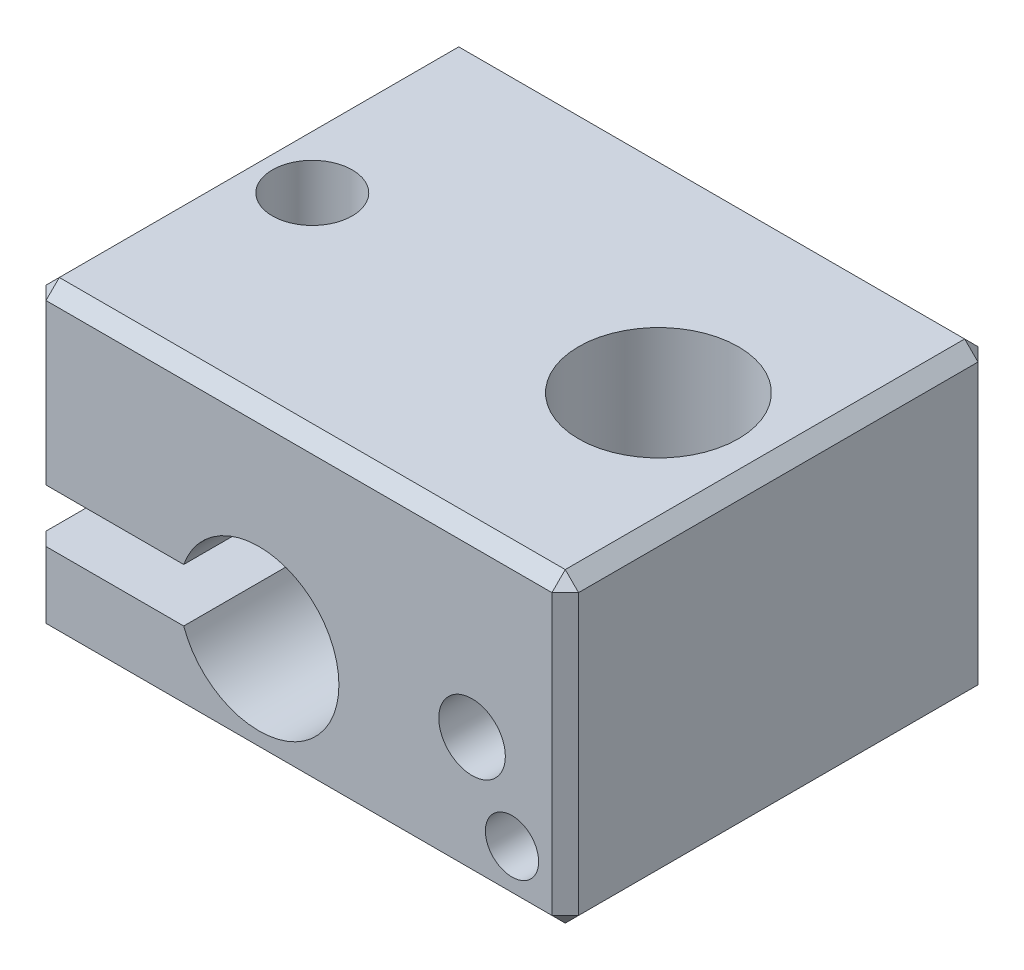
ISO-10303-21;
HEADER;
FILE_DESCRIPTION(('STEP AP214'),'2;1');
FILE_NAME('part.step','',(''),(''),'','','');
FILE_SCHEMA(('AUTOMOTIVE_DESIGN { 1 0 10303 214 1 1 1 1 }'));
ENDSEC;
DATA;
#1=APPLICATION_CONTEXT('core data for automotive mechanical design processes');
#2=APPLICATION_PROTOCOL_DEFINITION('international standard','automotive_design',2000,#1);
#3=PRODUCT_CONTEXT('',#1,'mechanical');
#4=PRODUCT('Part','Part','',(#3));
#5=PRODUCT_RELATED_PRODUCT_CATEGORY('part','',(#4));
#6=PRODUCT_DEFINITION_FORMATION('','',#4);
#7=PRODUCT_DEFINITION_CONTEXT('part definition',#1,'design');
#8=PRODUCT_DEFINITION('design','',#6,#7);
#9=PRODUCT_DEFINITION_SHAPE('','',#8);
#10=(LENGTH_UNIT() NAMED_UNIT(*) SI_UNIT(.MILLI.,.METRE.));
#11=(NAMED_UNIT(*) PLANE_ANGLE_UNIT() SI_UNIT($,.RADIAN.));
#12=(NAMED_UNIT(*) SI_UNIT($,.STERADIAN.) SOLID_ANGLE_UNIT());
#13=UNCERTAINTY_MEASURE_WITH_UNIT(LENGTH_MEASURE(1.E-05),#10,'distance_accuracy_value','');
#14=(GEOMETRIC_REPRESENTATION_CONTEXT(3) GLOBAL_UNCERTAINTY_ASSIGNED_CONTEXT((#13)) GLOBAL_UNIT_ASSIGNED_CONTEXT((#10,
#11,#12)) REPRESENTATION_CONTEXT('',''));
#15=CARTESIAN_POINT('',(0.,0.,0.));
#16=DIRECTION('',(0.,0.,1.));
#17=DIRECTION('',(1.,0.,0.));
#18=AXIS2_PLACEMENT_3D('',#15,#16,#17);
#19=CARTESIAN_POINT('',(-10.,11.5,-8.));
#20=DIRECTION('',(1.,0.,0.));
#21=DIRECTION('',(0.,0.,-1.));
#22=AXIS2_PLACEMENT_3D('',#19,#20,#21);
#23=PLANE('',#22);
#24=DIRECTION('',(0.,0.,1.));
#25=VECTOR('',#24,1.);
#26=CARTESIAN_POINT('',(-10.,5.,-8.));
#27=LINE('',#26,#25);
#28=CARTESIAN_POINT('',(-10.,5.,-7.49999999999999));
#29=VERTEX_POINT('',#28);
#30=CARTESIAN_POINT('',(-10.,5.,7.49999999999999));
#31=VERTEX_POINT('',#30);
#32=EDGE_CURVE('E169',#29,#31,#27,.T.);
#33=ORIENTED_EDGE('',*,*,#32,.T.);
#34=DIRECTION('',(0.,1.,0.));
#35=VECTOR('',#34,1.);
#36=CARTESIAN_POINT('',(-10.,11.5,7.49999999999999));
#37=LINE('',#36,#35);
#38=CARTESIAN_POINT('',(-10.,11.,7.49999999999999));
#39=VERTEX_POINT('',#38);
#40=EDGE_CURVE('E254',#31,#39,#37,.T.);
#41=ORIENTED_EDGE('',*,*,#40,.T.);
#42=DIRECTION('',(0.,0.,-1.));
#43=VECTOR('',#42,1.);
#44=CARTESIAN_POINT('',(-10.,11.,-8.));
#45=LINE('',#44,#43);
#46=CARTESIAN_POINT('',(-10.,11.,-7.49999999999999));
#47=VERTEX_POINT('',#46);
#48=EDGE_CURVE('E252',#39,#47,#45,.T.);
#49=ORIENTED_EDGE('',*,*,#48,.T.);
#50=DIRECTION('',(0.,-1.,0.));
#51=VECTOR('',#50,1.);
#52=CARTESIAN_POINT('',(-10.,11.5,-7.49999999999999));
#53=LINE('',#52,#51);
#54=EDGE_CURVE('E250',#47,#29,#53,.T.);
#55=ORIENTED_EDGE('',*,*,#54,.T.);
#56=EDGE_LOOP('',(#33,#41,#49,#55));
#57=FACE_BOUND('',#56,.T.);
#58=ADVANCED_FACE('F32',(#57),#23,.F.);
#59=CARTESIAN_POINT('',(-7.5,11.5,0.));
#60=DIRECTION('',(0.,-1.,0.));
#61=DIRECTION('',(0.,0.,-1.));
#62=AXIS2_PLACEMENT_3D('',#59,#60,#61);
#63=CYLINDRICAL_SURFACE('',#62,1.5);
#64=CARTESIAN_POINT('',(-7.5,5.,0.));
#65=DIRECTION('',(0.,1.,0.));
#66=DIRECTION('',(0.,0.,1.));
#67=AXIS2_PLACEMENT_3D('',#64,#65,#66);
#68=CIRCLE('',#67,1.5);
#69=CARTESIAN_POINT('',(-7.5,5.,1.5));
#70=VERTEX_POINT('',#69);
#71=EDGE_CURVE('E208',#70,#70,#68,.T.);
#72=ORIENTED_EDGE('',*,*,#71,.F.);
#73=EDGE_LOOP('',(#72));
#74=FACE_BOUND('',#73,.T.);
#75=CARTESIAN_POINT('',(-7.5,11.5,0.));
#76=DIRECTION('',(0.,1.,0.));
#77=DIRECTION('',(0.,0.,1.));
#78=AXIS2_PLACEMENT_3D('',#75,#76,#77);
#79=CIRCLE('',#78,1.5);
#80=CARTESIAN_POINT('',(-7.5,11.5,1.5));
#81=VERTEX_POINT('',#80);
#82=EDGE_CURVE('E201',#81,#81,#79,.T.);
#83=ORIENTED_EDGE('',*,*,#82,.T.);
#84=EDGE_LOOP('',(#83));
#85=FACE_BOUND('',#84,.T.);
#86=ADVANCED_FACE('F478',(#74,#85),#63,.F.);
#87=CARTESIAN_POINT('',(0.,11.5,0.));
#88=DIRECTION('',(0.,-1.,0.));
#89=DIRECTION('',(0.,0.,-1.));
#90=AXIS2_PLACEMENT_3D('',#87,#88,#89);
#91=PLANE('',#90);
#92=DIRECTION('',(1.,0.,0.));
#93=VECTOR('',#92,1.);
#94=CARTESIAN_POINT('',(0.,11.5,7.49999999999999));
#95=LINE('',#94,#93);
#96=CARTESIAN_POINT('',(-9.5,11.5,7.49999999999999));
#97=VERTEX_POINT('',#96);
#98=CARTESIAN_POINT('',(9.5,11.5,7.49999999999999));
#99=VERTEX_POINT('',#98);
#100=EDGE_CURVE('E222',#97,#99,#95,.T.);
#101=ORIENTED_EDGE('',*,*,#100,.T.);
#102=DIRECTION('',(0.,0.,-1.));
#103=VECTOR('',#102,1.);
#104=CARTESIAN_POINT('',(9.5,11.5,0.));
#105=LINE('',#104,#103);
#106=CARTESIAN_POINT('',(9.5,11.5,-7.5));
#107=VERTEX_POINT('',#106);
#108=EDGE_CURVE('E224',#99,#107,#105,.T.);
#109=ORIENTED_EDGE('',*,*,#108,.T.);
#110=DIRECTION('',(-1.,0.,0.));
#111=VECTOR('',#110,1.);
#112=CARTESIAN_POINT('',(0.,11.5,-7.5));
#113=LINE('',#112,#111);
#114=CARTESIAN_POINT('',(-9.5,11.5,-7.49999999999999));
#115=VERTEX_POINT('',#114);
#116=EDGE_CURVE('E212',#107,#115,#113,.T.);
#117=ORIENTED_EDGE('',*,*,#116,.T.);
#118=DIRECTION('',(0.,0.,1.));
#119=VECTOR('',#118,1.);
#120=CARTESIAN_POINT('',(-9.5,11.5,0.));
#121=LINE('',#120,#119);
#122=EDGE_CURVE('E220',#115,#97,#121,.T.);
#123=ORIENTED_EDGE('',*,*,#122,.T.);
#124=EDGE_LOOP('',(#101,#109,#117,#123));
#125=FACE_BOUND('',#124,.T.);
#126=CARTESIAN_POINT('',(5.5,11.5,0.));
#127=DIRECTION('',(0.,1.,0.));
#128=DIRECTION('',(0.,0.,1.));
#129=AXIS2_PLACEMENT_3D('',#126,#127,#128);
#130=CIRCLE('',#129,3.);
#131=CARTESIAN_POINT('',(5.5,11.5,3.));
#132=VERTEX_POINT('',#131);
#133=EDGE_CURVE('E209',#132,#132,#130,.T.);
#134=ORIENTED_EDGE('',*,*,#133,.F.);
#135=EDGE_LOOP('',(#134));
#136=FACE_BOUND('',#135,.T.);
#137=ORIENTED_EDGE('',*,*,#82,.F.);
#138=EDGE_LOOP('',(#137));
#139=FACE_BOUND('',#138,.T.);
#140=ADVANCED_FACE('F392',(#125,#136,#139),#91,.F.);
#141=CARTESIAN_POINT('',(0.,0.,0.));
#142=DIRECTION('',(0.,-1.,0.));
#143=DIRECTION('',(0.,0.,-1.));
#144=AXIS2_PLACEMENT_3D('',#141,#142,#143);
#145=PLANE('',#144);
#146=DIRECTION('',(1.,0.,0.));
#147=VECTOR('',#146,1.);
#148=CARTESIAN_POINT('',(10.,0.,-7.49999999999999));
#149=LINE('',#148,#147);
#150=CARTESIAN_POINT('',(-9.49999999999999,0.,-7.49999999999999));
#151=VERTEX_POINT('',#150);
#152=CARTESIAN_POINT('',(9.49999999999999,0.,-7.49999999999999));
#153=VERTEX_POINT('',#152);
#154=EDGE_CURVE('E41',#151,#153,#149,.T.);
#155=ORIENTED_EDGE('',*,*,#154,.T.);
#156=DIRECTION('',(0.,0.,1.));
#157=VECTOR('',#156,1.);
#158=CARTESIAN_POINT('',(9.49999999999999,0.,8.));
#159=LINE('',#158,#157);
#160=CARTESIAN_POINT('',(9.49999999999999,0.,7.49999999999999));
#161=VERTEX_POINT('',#160);
#162=EDGE_CURVE('E11',#153,#161,#159,.T.);
#163=ORIENTED_EDGE('',*,*,#162,.T.);
#164=DIRECTION('',(-1.,0.,0.));
#165=VECTOR('',#164,1.);
#166=CARTESIAN_POINT('',(-10.,0.,7.49999999999999));
#167=LINE('',#166,#165);
#168=CARTESIAN_POINT('',(-9.49999999999999,0.,7.49999999999999));
#169=VERTEX_POINT('',#168);
#170=EDGE_CURVE('E276',#161,#169,#167,.T.);
#171=ORIENTED_EDGE('',*,*,#170,.T.);
#172=DIRECTION('',(0.,0.,-1.));
#173=VECTOR('',#172,1.);
#174=CARTESIAN_POINT('',(-9.49999999999999,0.,-8.));
#175=LINE('',#174,#173);
#176=EDGE_CURVE('E52',#169,#151,#175,.T.);
#177=ORIENTED_EDGE('',*,*,#176,.T.);
#178=EDGE_LOOP('',(#155,#163,#171,#177));
#179=FACE_BOUND('',#178,.T.);
#180=CARTESIAN_POINT('',(5.5,0.,0.));
#181=DIRECTION('',(0.,1.,0.));
#182=DIRECTION('',(0.,0.,1.));
#183=AXIS2_PLACEMENT_3D('',#180,#181,#182);
#184=CIRCLE('',#183,3.);
#185=CARTESIAN_POINT('',(5.5,0.,3.));
#186=VERTEX_POINT('',#185);
#187=EDGE_CURVE('E204',#186,#186,#184,.T.);
#188=ORIENTED_EDGE('',*,*,#187,.T.);
#189=EDGE_LOOP('',(#188));
#190=FACE_BOUND('',#189,.T.);
#191=CARTESIAN_POINT('',(-7.5,0.,0.));
#192=DIRECTION('',(0.,1.,0.));
#193=DIRECTION('',(0.,0.,1.));
#194=AXIS2_PLACEMENT_3D('',#191,#192,#193);
#195=CIRCLE('',#194,1.5);
#196=CARTESIAN_POINT('',(-7.5,0.,1.5));
#197=VERTEX_POINT('',#196);
#198=EDGE_CURVE('E205',#197,#197,#195,.T.);
#199=ORIENTED_EDGE('',*,*,#198,.T.);
#200=EDGE_LOOP('',(#199));
#201=FACE_BOUND('',#200,.T.);
#202=ADVANCED_FACE('F487',(#179,#190,#201),#145,.T.);
#203=DIRECTION('',(0.,0.,1.));
#204=VECTOR('',#203,1.);
#205=CARTESIAN_POINT('',(-10.,3.,-8.));
#206=LINE('',#205,#204);
#207=CARTESIAN_POINT('',(-10.,3.,-7.49999999999999));
#208=VERTEX_POINT('',#207);
#209=CARTESIAN_POINT('',(-10.,3.,7.49999999999999));
#210=VERTEX_POINT('',#209);
#211=EDGE_CURVE('E180',#208,#210,#206,.T.);
#212=ORIENTED_EDGE('',*,*,#211,.F.);
#213=DIRECTION('',(0.,-1.,0.));
#214=VECTOR('',#213,1.);
#215=CARTESIAN_POINT('',(-10.,11.5,-7.49999999999999));
#216=LINE('',#215,#214);
#217=CARTESIAN_POINT('',(-10.,0.500000000000004,-7.49999999999999));
#218=VERTEX_POINT('',#217);
#219=EDGE_CURVE('E270',#208,#218,#216,.T.);
#220=ORIENTED_EDGE('',*,*,#219,.T.);
#221=DIRECTION('',(0.,0.,1.));
#222=VECTOR('',#221,1.);
#223=CARTESIAN_POINT('',(-10.,0.500000000000004,8.));
#224=LINE('',#223,#222);
#225=CARTESIAN_POINT('',(-10.,0.500000000000004,7.49999999999999));
#226=VERTEX_POINT('',#225);
#227=EDGE_CURVE('E266',#218,#226,#224,.T.);
#228=ORIENTED_EDGE('',*,*,#227,.T.);
#229=DIRECTION('',(0.,1.,0.));
#230=VECTOR('',#229,1.);
#231=CARTESIAN_POINT('',(-10.,11.5,7.49999999999999));
#232=LINE('',#231,#230);
#233=EDGE_CURVE('E268',#226,#210,#232,.T.);
#234=ORIENTED_EDGE('',*,*,#233,.T.);
#235=EDGE_LOOP('',(#212,#220,#228,#234));
#236=FACE_BOUND('',#235,.T.);
#237=ADVANCED_FACE('F368',(#236),#23,.F.);
#238=CARTESIAN_POINT('',(10.,11.5,8.));
#239=DIRECTION('',(0.,0.,-1.));
#240=DIRECTION('',(-1.,0.,0.));
#241=AXIS2_PLACEMENT_3D('',#238,#239,#240);
#242=PLANE('',#241);
#243=CARTESIAN_POINT('',(8.,2.,8.));
#244=DIRECTION('',(0.,0.,1.));
#245=DIRECTION('',(1.,0.,0.));
#246=AXIS2_PLACEMENT_3D('',#243,#244,#245);
#247=CIRCLE('',#246,1.);
#248=CARTESIAN_POINT('',(9.,2.,8.));
#249=VERTEX_POINT('',#248);
#250=EDGE_CURVE('E347',#249,#249,#247,.T.);
#251=ORIENTED_EDGE('',*,*,#250,.F.);
#252=EDGE_LOOP('',(#251));
#253=FACE_BOUND('',#252,.T.);
#254=CARTESIAN_POINT('',(6.5,4.8,8.));
#255=DIRECTION('',(0.,0.,1.));
#256=DIRECTION('',(1.,0.,0.));
#257=AXIS2_PLACEMENT_3D('',#254,#255,#256);
#258=CIRCLE('',#257,1.25);
#259=CARTESIAN_POINT('',(7.75,4.8,8.));
#260=VERTEX_POINT('',#259);
#261=EDGE_CURVE('E355',#260,#260,#258,.T.);
#262=ORIENTED_EDGE('',*,*,#261,.F.);
#263=EDGE_LOOP('',(#262));
#264=FACE_BOUND('',#263,.T.);
#265=DIRECTION('',(-1.,0.,0.));
#266=VECTOR('',#265,1.);
#267=CARTESIAN_POINT('',(10.,11.,8.));
#268=LINE('',#267,#266);
#269=CARTESIAN_POINT('',(9.5,11.,8.));
#270=VERTEX_POINT('',#269);
#271=CARTESIAN_POINT('',(-9.5,11.,8.));
#272=VERTEX_POINT('',#271);
#273=EDGE_CURVE('E242',#270,#272,#268,.T.);
#274=ORIENTED_EDGE('',*,*,#273,.T.);
#275=DIRECTION('',(0.,-1.,0.));
#276=VECTOR('',#275,1.);
#277=CARTESIAN_POINT('',(-9.5,11.5,8.));
#278=LINE('',#277,#276);
#279=CARTESIAN_POINT('',(-9.5,5.,8.));
#280=VERTEX_POINT('',#279);
#281=EDGE_CURVE('E245',#272,#280,#278,.T.);
#282=ORIENTED_EDGE('',*,*,#281,.T.);
#283=DIRECTION('',(-1.,0.,0.));
#284=VECTOR('',#283,1.);
#285=CARTESIAN_POINT('',(-10.,5.,8.));
#286=LINE('',#285,#284);
#287=CARTESIAN_POINT('',(-4.32842712474619,5.,8.));
#288=VERTEX_POINT('',#287);
#289=EDGE_CURVE('E186',#288,#280,#286,.T.);
#290=ORIENTED_EDGE('',*,*,#289,.F.);
#291=CARTESIAN_POINT('',(-1.5,4.,8.));
#292=DIRECTION('',(0.,0.,1.));
#293=DIRECTION('',(1.,0.,0.));
#294=AXIS2_PLACEMENT_3D('',#291,#292,#293);
#295=CIRCLE('',#294,3.);
#296=CARTESIAN_POINT('',(-4.32842712474619,3.,8.));
#297=VERTEX_POINT('',#296);
#298=EDGE_CURVE('E165',#297,#288,#295,.T.);
#299=ORIENTED_EDGE('',*,*,#298,.F.);
#300=DIRECTION('',(1.,0.,0.));
#301=VECTOR('',#300,1.);
#302=CARTESIAN_POINT('',(-10.,3.,8.));
#303=LINE('',#302,#301);
#304=CARTESIAN_POINT('',(-9.5,3.,8.));
#305=VERTEX_POINT('',#304);
#306=EDGE_CURVE('E190',#305,#297,#303,.T.);
#307=ORIENTED_EDGE('',*,*,#306,.F.);
#308=DIRECTION('',(0.,-1.,0.));
#309=VECTOR('',#308,1.);
#310=CARTESIAN_POINT('',(-9.5,11.5,8.));
#311=LINE('',#310,#309);
#312=CARTESIAN_POINT('',(-9.5,0.500000000000004,8.));
#313=VERTEX_POINT('',#312);
#314=EDGE_CURVE('E240',#305,#313,#311,.T.);
#315=ORIENTED_EDGE('',*,*,#314,.T.);
#316=DIRECTION('',(1.,0.,0.));
#317=VECTOR('',#316,1.);
#318=CARTESIAN_POINT('',(10.,0.500000000000004,8.));
#319=LINE('',#318,#317);
#320=CARTESIAN_POINT('',(9.5,0.500000000000004,8.));
#321=VERTEX_POINT('',#320);
#322=EDGE_CURVE('E236',#313,#321,#319,.T.);
#323=ORIENTED_EDGE('',*,*,#322,.T.);
#324=DIRECTION('',(0.,1.,0.));
#325=VECTOR('',#324,1.);
#326=CARTESIAN_POINT('',(9.5,11.5,8.));
#327=LINE('',#326,#325);
#328=EDGE_CURVE('E238',#321,#270,#327,.T.);
#329=ORIENTED_EDGE('',*,*,#328,.T.);
#330=EDGE_LOOP('',(#274,#282,#290,#299,#307,#315,#323,#329));
#331=FACE_BOUND('',#330,.T.);
#332=ADVANCED_FACE('F364',(#253,#264,#331),#242,.F.);
#333=CARTESIAN_POINT('',(10.,11.5,-8.));
#334=DIRECTION('',(-1.,0.,0.));
#335=DIRECTION('',(0.,0.,1.));
#336=AXIS2_PLACEMENT_3D('',#333,#334,#335);
#337=PLANE('',#336);
#338=DIRECTION('',(0.,1.,0.));
#339=VECTOR('',#338,1.);
#340=CARTESIAN_POINT('',(10.,11.5,-7.49999999999999));
#341=LINE('',#340,#339);
#342=CARTESIAN_POINT('',(10.,0.500000000000004,-7.49999999999999));
#343=VERTEX_POINT('',#342);
#344=CARTESIAN_POINT('',(10.,11.,-7.49999999999999));
#345=VERTEX_POINT('',#344);
#346=EDGE_CURVE('E231',#343,#345,#341,.T.);
#347=ORIENTED_EDGE('',*,*,#346,.T.);
#348=DIRECTION('',(0.,0.,1.));
#349=VECTOR('',#348,1.);
#350=CARTESIAN_POINT('',(10.,11.,-8.));
#351=LINE('',#350,#349);
#352=CARTESIAN_POINT('',(10.,11.,7.49999999999999));
#353=VERTEX_POINT('',#352);
#354=EDGE_CURVE('E233',#345,#353,#351,.T.);
#355=ORIENTED_EDGE('',*,*,#354,.T.);
#356=DIRECTION('',(0.,-1.,0.));
#357=VECTOR('',#356,1.);
#358=CARTESIAN_POINT('',(10.,11.5,7.49999999999999));
#359=LINE('',#358,#357);
#360=CARTESIAN_POINT('',(10.,0.500000000000004,7.49999999999999));
#361=VERTEX_POINT('',#360);
#362=EDGE_CURVE('E227',#353,#361,#359,.T.);
#363=ORIENTED_EDGE('',*,*,#362,.T.);
#364=DIRECTION('',(0.,0.,-1.));
#365=VECTOR('',#364,1.);
#366=CARTESIAN_POINT('',(10.,0.500000000000004,-8.));
#367=LINE('',#366,#365);
#368=EDGE_CURVE('E229',#361,#343,#367,.T.);
#369=ORIENTED_EDGE('',*,*,#368,.T.);
#370=EDGE_LOOP('',(#347,#355,#363,#369));
#371=FACE_BOUND('',#370,.T.);
#372=ADVANCED_FACE('F367',(#371),#337,.F.);
#373=CARTESIAN_POINT('',(10.,11.5,-8.));
#374=DIRECTION('',(0.,0.,1.));
#375=DIRECTION('',(1.,0.,0.));
#376=AXIS2_PLACEMENT_3D('',#373,#374,#375);
#377=PLANE('',#376);
#378=DIRECTION('',(-1.,0.,0.));
#379=VECTOR('',#378,1.);
#380=CARTESIAN_POINT('',(-10.,5.,-8.));
#381=LINE('',#380,#379);
#382=CARTESIAN_POINT('',(-4.32842712474619,5.,-8.));
#383=VERTEX_POINT('',#382);
#384=CARTESIAN_POINT('',(-9.49999999999999,5.,-8.));
#385=VERTEX_POINT('',#384);
#386=EDGE_CURVE('E173',#383,#385,#381,.T.);
#387=ORIENTED_EDGE('',*,*,#386,.T.);
#388=DIRECTION('',(0.,1.,0.));
#389=VECTOR('',#388,1.);
#390=CARTESIAN_POINT('',(-9.49999999999999,11.5,-8.));
#391=LINE('',#390,#389);
#392=CARTESIAN_POINT('',(-9.49999999999999,11.,-8.));
#393=VERTEX_POINT('',#392);
#394=EDGE_CURVE('E264',#385,#393,#391,.T.);
#395=ORIENTED_EDGE('',*,*,#394,.T.);
#396=DIRECTION('',(1.,0.,0.));
#397=VECTOR('',#396,1.);
#398=CARTESIAN_POINT('',(10.,11.,-8.));
#399=LINE('',#398,#397);
#400=CARTESIAN_POINT('',(9.5,11.,-8.));
#401=VERTEX_POINT('',#400);
#402=EDGE_CURVE('E262',#393,#401,#399,.T.);
#403=ORIENTED_EDGE('',*,*,#402,.T.);
#404=DIRECTION('',(0.,-1.,0.));
#405=VECTOR('',#404,1.);
#406=CARTESIAN_POINT('',(9.5,11.5,-8.));
#407=LINE('',#406,#405);
#408=CARTESIAN_POINT('',(9.5,0.500000000000004,-8.));
#409=VERTEX_POINT('',#408);
#410=EDGE_CURVE('E258',#401,#409,#407,.T.);
#411=ORIENTED_EDGE('',*,*,#410,.T.);
#412=DIRECTION('',(-1.,0.,0.));
#413=VECTOR('',#412,1.);
#414=CARTESIAN_POINT('',(-10.,0.500000000000004,-8.));
#415=LINE('',#414,#413);
#416=CARTESIAN_POINT('',(-9.49999999999999,0.500000000000004,-8.));
#417=VERTEX_POINT('',#416);
#418=EDGE_CURVE('E256',#409,#417,#415,.T.);
#419=ORIENTED_EDGE('',*,*,#418,.T.);
#420=DIRECTION('',(0.,1.,0.));
#421=VECTOR('',#420,1.);
#422=CARTESIAN_POINT('',(-9.49999999999999,11.5,-8.));
#423=LINE('',#422,#421);
#424=CARTESIAN_POINT('',(-9.49999999999999,3.,-8.));
#425=VERTEX_POINT('',#424);
#426=EDGE_CURVE('E260',#417,#425,#423,.T.);
#427=ORIENTED_EDGE('',*,*,#426,.T.);
#428=DIRECTION('',(1.,0.,0.));
#429=VECTOR('',#428,1.);
#430=CARTESIAN_POINT('',(-10.,3.,-8.));
#431=LINE('',#430,#429);
#432=CARTESIAN_POINT('',(-4.32842712474619,3.,-8.));
#433=VERTEX_POINT('',#432);
#434=EDGE_CURVE('E184',#425,#433,#431,.T.);
#435=ORIENTED_EDGE('',*,*,#434,.T.);
#436=CARTESIAN_POINT('',(-1.5,4.,-8.));
#437=DIRECTION('',(0.,0.,1.));
#438=DIRECTION('',(1.,0.,0.));
#439=AXIS2_PLACEMENT_3D('',#436,#437,#438);
#440=CIRCLE('',#439,3.);
#441=EDGE_CURVE('E162',#433,#383,#440,.T.);
#442=ORIENTED_EDGE('',*,*,#441,.T.);
#443=EDGE_LOOP('',(#387,#395,#403,#411,#419,#427,#435,#442));
#444=FACE_BOUND('',#443,.T.);
#445=ADVANCED_FACE('F182',(#444),#377,.F.);
#446=CARTESIAN_POINT('',(5.5,11.5,0.));
#447=DIRECTION('',(0.,-1.,0.));
#448=DIRECTION('',(0.,0.,-1.));
#449=AXIS2_PLACEMENT_3D('',#446,#447,#448);
#450=CYLINDRICAL_SURFACE('',#449,3.);
#451=ORIENTED_EDGE('',*,*,#133,.T.);
#452=EDGE_LOOP('',(#451));
#453=FACE_BOUND('',#452,.T.);
#454=ORIENTED_EDGE('',*,*,#187,.F.);
#455=EDGE_LOOP('',(#454));
#456=FACE_BOUND('',#455,.T.);
#457=ADVANCED_FACE('F501',(#453,#456),#450,.F.);
#458=CARTESIAN_POINT('',(-7.5,3.,0.));
#459=DIRECTION('',(0.,-1.,0.));
#460=DIRECTION('',(0.,0.,-1.));
#461=AXIS2_PLACEMENT_3D('',#458,#459,#460);
#462=CIRCLE('',#461,1.5);
#463=CARTESIAN_POINT('',(-7.5,3.,-1.5));
#464=VERTEX_POINT('',#463);
#465=EDGE_CURVE('E196',#464,#464,#462,.T.);
#466=ORIENTED_EDGE('',*,*,#465,.F.);
#467=EDGE_LOOP('',(#466));
#468=FACE_BOUND('',#467,.T.);
#469=ORIENTED_EDGE('',*,*,#198,.F.);
#470=EDGE_LOOP('',(#469));
#471=FACE_BOUND('',#470,.T.);
#472=ADVANCED_FACE('F485',(#468,#471),#63,.F.);
#473=CARTESIAN_POINT('',(-10.,5.,-8.));
#474=DIRECTION('',(0.,1.,0.));
#475=DIRECTION('',(0.,0.,1.));
#476=AXIS2_PLACEMENT_3D('',#473,#474,#475);
#477=PLANE('',#476);
#478=ORIENTED_EDGE('',*,*,#71,.T.);
#479=EDGE_LOOP('',(#478));
#480=FACE_BOUND('',#479,.T.);
#481=ORIENTED_EDGE('',*,*,#289,.T.);
#482=DIRECTION('',(0.707106781186545,0.,0.70710678118655));
#483=VECTOR('',#482,1.);
#484=CARTESIAN_POINT('',(-9.5,5.,8.));
#485=LINE('',#484,#483);
#486=EDGE_CURVE('E248',#280,#31,#485,.F.);
#487=ORIENTED_EDGE('',*,*,#486,.T.);
#488=ORIENTED_EDGE('',*,*,#32,.F.);
#489=DIRECTION('',(-0.70710678118655,0.,0.707106781186545));
#490=VECTOR('',#489,1.);
#491=CARTESIAN_POINT('',(-10.,5.,-7.49999999999999));
#492=LINE('',#491,#490);
#493=EDGE_CURVE('E177',#29,#385,#492,.F.);
#494=ORIENTED_EDGE('',*,*,#493,.T.);
#495=ORIENTED_EDGE('',*,*,#386,.F.);
#496=DIRECTION('',(0.,0.,1.));
#497=VECTOR('',#496,1.);
#498=CARTESIAN_POINT('',(-4.32842712474619,5.,-8.));
#499=LINE('',#498,#497);
#500=EDGE_CURVE('E157',#383,#288,#499,.T.);
#501=ORIENTED_EDGE('',*,*,#500,.T.);
#502=EDGE_LOOP('',(#481,#487,#488,#494,#495,#501));
#503=FACE_BOUND('',#502,.T.);
#504=ADVANCED_FACE('F174',(#480,#503),#477,.F.);
#505=CARTESIAN_POINT('',(-1.5,4.,-8.));
#506=DIRECTION('',(0.,0.,1.));
#507=DIRECTION('',(1.,0.,0.));
#508=AXIS2_PLACEMENT_3D('',#505,#506,#507);
#509=CYLINDRICAL_SURFACE('',#508,3.);
#510=ORIENTED_EDGE('',*,*,#298,.T.);
#511=ORIENTED_EDGE('',*,*,#500,.F.);
#512=ORIENTED_EDGE('',*,*,#441,.F.);
#513=DIRECTION('',(0.,0.,1.));
#514=VECTOR('',#513,1.);
#515=CARTESIAN_POINT('',(-4.32842712474619,3.,-8.));
#516=LINE('',#515,#514);
#517=EDGE_CURVE('E170',#433,#297,#516,.T.);
#518=ORIENTED_EDGE('',*,*,#517,.T.);
#519=EDGE_LOOP('',(#510,#511,#512,#518));
#520=FACE_BOUND('',#519,.T.);
#521=ADVANCED_FACE('F159',(#520),#509,.F.);
#522=CARTESIAN_POINT('',(-10.,3.,-8.));
#523=DIRECTION('',(0.,-1.,0.));
#524=DIRECTION('',(0.,0.,-1.));
#525=AXIS2_PLACEMENT_3D('',#522,#523,#524);
#526=PLANE('',#525);
#527=ORIENTED_EDGE('',*,*,#465,.T.);
#528=EDGE_LOOP('',(#527));
#529=FACE_BOUND('',#528,.T.);
#530=ORIENTED_EDGE('',*,*,#434,.F.);
#531=DIRECTION('',(0.70710678118655,0.,-0.707106781186545));
#532=VECTOR('',#531,1.);
#533=CARTESIAN_POINT('',(-10.,3.,-7.49999999999999));
#534=LINE('',#533,#532);
#535=EDGE_CURVE('E274',#425,#208,#534,.F.);
#536=ORIENTED_EDGE('',*,*,#535,.T.);
#537=ORIENTED_EDGE('',*,*,#211,.T.);
#538=DIRECTION('',(-0.707106781186545,0.,-0.70710678118655));
#539=VECTOR('',#538,1.);
#540=CARTESIAN_POINT('',(-9.5,3.,8.));
#541=LINE('',#540,#539);
#542=EDGE_CURVE('E272',#210,#305,#541,.F.);
#543=ORIENTED_EDGE('',*,*,#542,.T.);
#544=ORIENTED_EDGE('',*,*,#306,.T.);
#545=ORIENTED_EDGE('',*,*,#517,.F.);
#546=EDGE_LOOP('',(#530,#536,#537,#543,#544,#545));
#547=FACE_BOUND('',#546,.T.);
#548=ADVANCED_FACE('F453',(#529,#547),#526,.F.);
#549=CARTESIAN_POINT('',(6.5,4.8,5.));
#550=DIRECTION('',(0.,0.,1.));
#551=DIRECTION('',(1.,0.,0.));
#552=AXIS2_PLACEMENT_3D('',#549,#550,#551);
#553=CYLINDRICAL_SURFACE('',#552,1.25);
#554=CARTESIAN_POINT('',(6.5,4.8,5.));
#555=DIRECTION('',(0.,0.,1.));
#556=DIRECTION('',(1.,0.,0.));
#557=AXIS2_PLACEMENT_3D('',#554,#555,#556);
#558=CIRCLE('',#557,1.25);
#559=CARTESIAN_POINT('',(7.75,4.8,5.));
#560=VERTEX_POINT('',#559);
#561=EDGE_CURVE('E192',#560,#560,#558,.T.);
#562=ORIENTED_EDGE('',*,*,#561,.F.);
#563=EDGE_LOOP('',(#562));
#564=FACE_BOUND('',#563,.T.);
#565=ORIENTED_EDGE('',*,*,#261,.T.);
#566=EDGE_LOOP('',(#565));
#567=FACE_BOUND('',#566,.T.);
#568=ADVANCED_FACE('F362',(#564,#567),#553,.F.);
#569=CARTESIAN_POINT('',(6.5,4.8,5.));
#570=DIRECTION('',(0.,0.,1.));
#571=DIRECTION('',(1.,0.,0.));
#572=AXIS2_PLACEMENT_3D('',#569,#570,#571);
#573=PLANE('',#572);
#574=ORIENTED_EDGE('',*,*,#561,.T.);
#575=EDGE_LOOP('',(#574));
#576=FACE_BOUND('',#575,.T.);
#577=ADVANCED_FACE('F551',(#576),#573,.T.);
#578=CARTESIAN_POINT('',(8.,2.,5.));
#579=DIRECTION('',(0.,0.,1.));
#580=DIRECTION('',(1.,0.,0.));
#581=AXIS2_PLACEMENT_3D('',#578,#579,#580);
#582=CYLINDRICAL_SURFACE('',#581,1.);
#583=CARTESIAN_POINT('',(8.,2.,5.));
#584=DIRECTION('',(0.,0.,1.));
#585=DIRECTION('',(1.,0.,0.));
#586=AXIS2_PLACEMENT_3D('',#583,#584,#585);
#587=CIRCLE('',#586,1.);
#588=CARTESIAN_POINT('',(9.,2.,5.));
#589=VERTEX_POINT('',#588);
#590=EDGE_CURVE('E350',#589,#589,#587,.T.);
#591=ORIENTED_EDGE('',*,*,#590,.F.);
#592=EDGE_LOOP('',(#591));
#593=FACE_BOUND('',#592,.T.);
#594=ORIENTED_EDGE('',*,*,#250,.T.);
#595=EDGE_LOOP('',(#594));
#596=FACE_BOUND('',#595,.T.);
#597=ADVANCED_FACE('F559',(#593,#596),#582,.F.);
#598=CARTESIAN_POINT('',(8.,2.,5.));
#599=DIRECTION('',(0.,0.,1.));
#600=DIRECTION('',(1.,0.,0.));
#601=AXIS2_PLACEMENT_3D('',#598,#599,#600);
#602=PLANE('',#601);
#603=ORIENTED_EDGE('',*,*,#590,.T.);
#604=EDGE_LOOP('',(#603));
#605=FACE_BOUND('',#604,.T.);
#606=ADVANCED_FACE('F567',(#605),#602,.T.);
#607=CARTESIAN_POINT('',(-9.5,11.5,8.));
#608=DIRECTION('',(0.70710678118655,0.,-0.707106781186545));
#609=DIRECTION('',(0.,-1.,0.));
#610=AXIS2_PLACEMENT_3D('',#607,#608,#609);
#611=PLANE('',#610);
#612=ORIENTED_EDGE('',*,*,#542,.F.);
#613=ORIENTED_EDGE('',*,*,#233,.F.);
#614=DIRECTION('',(0.707106781186545,0.,0.70710678118655));
#615=VECTOR('',#614,1.);
#616=CARTESIAN_POINT('',(-9.5,0.500000000000004,8.));
#617=LINE('',#616,#615);
#618=EDGE_CURVE('E341',#313,#226,#617,.F.);
#619=ORIENTED_EDGE('',*,*,#618,.F.);
#620=ORIENTED_EDGE('',*,*,#314,.F.);
#621=EDGE_LOOP('',(#612,#613,#619,#620));
#622=FACE_BOUND('',#621,.T.);
#623=ADVANCED_FACE('F34',(#622),#611,.F.);
#624=CARTESIAN_POINT('',(-10.,11.5,-7.49999999999999));
#625=DIRECTION('',(0.707106781186545,0.,0.70710678118655));
#626=DIRECTION('',(0.,-1.,0.));
#627=AXIS2_PLACEMENT_3D('',#624,#625,#626);
#628=PLANE('',#627);
#629=ORIENTED_EDGE('',*,*,#535,.F.);
#630=ORIENTED_EDGE('',*,*,#426,.F.);
#631=DIRECTION('',(-0.70710678118655,0.,0.707106781186545));
#632=VECTOR('',#631,1.);
#633=CARTESIAN_POINT('',(-10.,0.500000000000004,-7.49999999999999));
#634=LINE('',#633,#632);
#635=EDGE_CURVE('E339',#218,#417,#634,.F.);
#636=ORIENTED_EDGE('',*,*,#635,.F.);
#637=ORIENTED_EDGE('',*,*,#219,.F.);
#638=EDGE_LOOP('',(#629,#630,#636,#637));
#639=FACE_BOUND('',#638,.T.);
#640=ADVANCED_FACE('F438',(#639),#628,.F.);
#641=CARTESIAN_POINT('',(-10.,0.500000000000004,-8.));
#642=DIRECTION('',(-0.707106781186545,-0.70710678118655,0.));
#643=DIRECTION('',(0.,0.,-1.));
#644=AXIS2_PLACEMENT_3D('',#641,#642,#643);
#645=PLANE('',#644);
#646=DIRECTION('',(0.70710678118655,-0.707106781186545,0.));
#647=VECTOR('',#646,1.);
#648=CARTESIAN_POINT('',(-9.75,0.250000000000002,7.49999999999999));
#649=LINE('',#648,#647);
#650=EDGE_CURVE('E36',#226,#169,#649,.T.);
#651=ORIENTED_EDGE('',*,*,#650,.F.);
#652=ORIENTED_EDGE('',*,*,#227,.F.);
#653=DIRECTION('',(-0.70710678118655,0.707106781186545,0.));
#654=VECTOR('',#653,1.);
#655=CARTESIAN_POINT('',(-10.,0.500000000000004,-7.49999999999999));
#656=LINE('',#655,#654);
#657=EDGE_CURVE('E336',#151,#218,#656,.T.);
#658=ORIENTED_EDGE('',*,*,#657,.F.);
#659=ORIENTED_EDGE('',*,*,#176,.F.);
#660=EDGE_LOOP('',(#651,#652,#658,#659));
#661=FACE_BOUND('',#660,.T.);
#662=ADVANCED_FACE('F444',(#661),#645,.T.);
#663=CARTESIAN_POINT('',(-9.5,0.500000000000004,8.));
#664=DIRECTION('',(-0.577350269189626,-0.57735026918963,0.577350269189622));
#665=DIRECTION('',(0.70710678118655,-0.707106781186545,0.));
#666=AXIS2_PLACEMENT_3D('',#663,#664,#665);
#667=PLANE('',#666);
#668=ORIENTED_EDGE('',*,*,#618,.T.);
#669=ORIENTED_EDGE('',*,*,#650,.T.);
#670=DIRECTION('',(0.,0.707106781186545,0.70710678118655));
#671=VECTOR('',#670,1.);
#672=CARTESIAN_POINT('',(-9.5,0.500000000000004,8.));
#673=LINE('',#672,#671);
#674=EDGE_CURVE('E333',#313,#169,#673,.F.);
#675=ORIENTED_EDGE('',*,*,#674,.F.);
#676=EDGE_LOOP('',(#668,#669,#675));
#677=FACE_BOUND('',#676,.T.);
#678=ADVANCED_FACE('F591',(#677),#667,.T.);
#679=CARTESIAN_POINT('',(-10.,0.500000000000004,-7.49999999999999));
#680=DIRECTION('',(-0.577350269189622,-0.57735026918963,-0.577350269189626));
#681=DIRECTION('',(0.,0.707106781186545,-0.70710678118655));
#682=AXIS2_PLACEMENT_3D('',#679,#680,#681);
#683=PLANE('',#682);
#684=ORIENTED_EDGE('',*,*,#657,.T.);
#685=ORIENTED_EDGE('',*,*,#635,.T.);
#686=DIRECTION('',(0.,-0.707106781186545,0.70710678118655));
#687=VECTOR('',#686,1.);
#688=CARTESIAN_POINT('',(-9.49999999999999,0.250000000000002,-7.74999999999999));
#689=LINE('',#688,#687);
#690=EDGE_CURVE('E330',#151,#417,#689,.F.);
#691=ORIENTED_EDGE('',*,*,#690,.F.);
#692=EDGE_LOOP('',(#684,#685,#691));
#693=FACE_BOUND('',#692,.T.);
#694=ADVANCED_FACE('F441',(#693),#683,.T.);
#695=CARTESIAN_POINT('',(10.,0.500000000000004,8.));
#696=DIRECTION('',(0.,-0.70710678118655,0.707106781186545));
#697=DIRECTION('',(-1.,0.,0.));
#698=AXIS2_PLACEMENT_3D('',#695,#696,#697);
#699=PLANE('',#698);
#700=ORIENTED_EDGE('',*,*,#674,.T.);
#701=ORIENTED_EDGE('',*,*,#170,.F.);
#702=DIRECTION('',(0.,-0.707106781186545,-0.70710678118655));
#703=VECTOR('',#702,1.);
#704=CARTESIAN_POINT('',(9.49999999999999,0.,7.49999999999999));
#705=LINE('',#704,#703);
#706=EDGE_CURVE('E325',#321,#161,#705,.T.);
#707=ORIENTED_EDGE('',*,*,#706,.F.);
#708=ORIENTED_EDGE('',*,*,#322,.F.);
#709=EDGE_LOOP('',(#700,#701,#707,#708));
#710=FACE_BOUND('',#709,.T.);
#711=ADVANCED_FACE('F459',(#710),#699,.T.);
#712=CARTESIAN_POINT('',(-9.5,11.5,8.));
#713=DIRECTION('',(0.70710678118655,0.,-0.707106781186545));
#714=DIRECTION('',(0.,-1.,0.));
#715=AXIS2_PLACEMENT_3D('',#712,#713,#714);
#716=PLANE('',#715);
#717=ORIENTED_EDGE('',*,*,#486,.F.);
#718=ORIENTED_EDGE('',*,*,#281,.F.);
#719=DIRECTION('',(-0.707106781186545,0.,-0.70710678118655));
#720=VECTOR('',#719,1.);
#721=CARTESIAN_POINT('',(-9.5,11.,8.));
#722=LINE('',#721,#720);
#723=EDGE_CURVE('E322',#39,#272,#722,.F.);
#724=ORIENTED_EDGE('',*,*,#723,.F.);
#725=ORIENTED_EDGE('',*,*,#40,.F.);
#726=EDGE_LOOP('',(#717,#718,#724,#725));
#727=FACE_BOUND('',#726,.T.);
#728=ADVANCED_FACE('F407',(#727),#716,.F.);
#729=CARTESIAN_POINT('',(-9.5,11.5,0.));
#730=DIRECTION('',(0.70710678118655,-0.707106781186545,0.));
#731=DIRECTION('',(0.,0.,1.));
#732=AXIS2_PLACEMENT_3D('',#729,#730,#731);
#733=PLANE('',#732);
#734=DIRECTION('',(-0.707106781186545,-0.70710678118655,0.));
#735=VECTOR('',#734,1.);
#736=CARTESIAN_POINT('',(-10.,11.,-7.49999999999999));
#737=LINE('',#736,#735);
#738=EDGE_CURVE('E316',#47,#115,#737,.F.);
#739=ORIENTED_EDGE('',*,*,#738,.F.);
#740=ORIENTED_EDGE('',*,*,#48,.F.);
#741=DIRECTION('',(0.707106781186545,0.70710678118655,0.));
#742=VECTOR('',#741,1.);
#743=CARTESIAN_POINT('',(-9.75,11.25,7.49999999999999));
#744=LINE('',#743,#742);
#745=EDGE_CURVE('E319',#97,#39,#744,.F.);
#746=ORIENTED_EDGE('',*,*,#745,.F.);
#747=ORIENTED_EDGE('',*,*,#122,.F.);
#748=EDGE_LOOP('',(#739,#740,#746,#747));
#749=FACE_BOUND('',#748,.T.);
#750=ADVANCED_FACE('F400',(#749),#733,.F.);
#751=CARTESIAN_POINT('',(-10.,11.5,-7.49999999999999));
#752=DIRECTION('',(0.707106781186545,0.,0.70710678118655));
#753=DIRECTION('',(0.,-1.,0.));
#754=AXIS2_PLACEMENT_3D('',#751,#752,#753);
#755=PLANE('',#754);
#756=ORIENTED_EDGE('',*,*,#493,.F.);
#757=ORIENTED_EDGE('',*,*,#54,.F.);
#758=DIRECTION('',(0.70710678118655,0.,-0.707106781186545));
#759=VECTOR('',#758,1.);
#760=CARTESIAN_POINT('',(-10.,11.,-7.49999999999999));
#761=LINE('',#760,#759);
#762=EDGE_CURVE('E313',#393,#47,#761,.F.);
#763=ORIENTED_EDGE('',*,*,#762,.F.);
#764=ORIENTED_EDGE('',*,*,#394,.F.);
#765=EDGE_LOOP('',(#756,#757,#763,#764));
#766=FACE_BOUND('',#765,.T.);
#767=ADVANCED_FACE('F412',(#766),#755,.F.);
#768=CARTESIAN_POINT('',(10.,0.500000000000004,-8.));
#769=DIRECTION('',(0.,-0.70710678118655,-0.707106781186545));
#770=DIRECTION('',(1.,0.,0.));
#771=AXIS2_PLACEMENT_3D('',#768,#769,#770);
#772=PLANE('',#771);
#773=ORIENTED_EDGE('',*,*,#690,.T.);
#774=ORIENTED_EDGE('',*,*,#418,.F.);
#775=DIRECTION('',(0.,0.707106781186545,-0.70710678118655));
#776=VECTOR('',#775,1.);
#777=CARTESIAN_POINT('',(9.5,0.500000000000004,-8.));
#778=LINE('',#777,#776);
#779=EDGE_CURVE('E310',#153,#409,#778,.T.);
#780=ORIENTED_EDGE('',*,*,#779,.F.);
#781=ORIENTED_EDGE('',*,*,#154,.F.);
#782=EDGE_LOOP('',(#773,#774,#780,#781));
#783=FACE_BOUND('',#782,.T.);
#784=ADVANCED_FACE('F432',(#783),#772,.T.);
#785=CARTESIAN_POINT('',(10.,0.500000000000004,-8.));
#786=DIRECTION('',(0.707106781186545,-0.70710678118655,0.));
#787=DIRECTION('',(0.,0.,1.));
#788=AXIS2_PLACEMENT_3D('',#785,#786,#787);
#789=PLANE('',#788);
#790=DIRECTION('',(0.70710678118655,0.707106781186545,0.));
#791=VECTOR('',#790,1.);
#792=CARTESIAN_POINT('',(9.49999999999999,0.,7.49999999999999));
#793=LINE('',#792,#791);
#794=EDGE_CURVE('E327',#161,#361,#793,.T.);
#795=ORIENTED_EDGE('',*,*,#794,.F.);
#796=ORIENTED_EDGE('',*,*,#162,.F.);
#797=DIRECTION('',(-0.70710678118655,-0.707106781186545,0.));
#798=VECTOR('',#797,1.);
#799=CARTESIAN_POINT('',(9.75,0.250000000000002,-7.49999999999999));
#800=LINE('',#799,#798);
#801=EDGE_CURVE('E307',#343,#153,#800,.T.);
#802=ORIENTED_EDGE('',*,*,#801,.F.);
#803=ORIENTED_EDGE('',*,*,#368,.F.);
#804=EDGE_LOOP('',(#795,#796,#802,#803));
#805=FACE_BOUND('',#804,.T.);
#806=ADVANCED_FACE('F465',(#805),#789,.T.);
#807=CARTESIAN_POINT('',(9.49999999999999,0.,7.49999999999999));
#808=DIRECTION('',(0.577350269189626,-0.57735026918963,0.577350269189622));
#809=DIRECTION('',(0.70710678118655,0.707106781186545,0.));
#810=AXIS2_PLACEMENT_3D('',#807,#808,#809);
#811=PLANE('',#810);
#812=ORIENTED_EDGE('',*,*,#706,.T.);
#813=ORIENTED_EDGE('',*,*,#794,.T.);
#814=DIRECTION('',(0.707106781186545,0.,-0.70710678118655));
#815=VECTOR('',#814,1.);
#816=CARTESIAN_POINT('',(9.75,0.500000000000004,7.75));
#817=LINE('',#816,#815);
#818=EDGE_CURVE('E304',#321,#361,#817,.T.);
#819=ORIENTED_EDGE('',*,*,#818,.F.);
#820=EDGE_LOOP('',(#812,#813,#819));
#821=FACE_BOUND('',#820,.T.);
#822=ADVANCED_FACE('F462',(#821),#811,.T.);
#823=CARTESIAN_POINT('',(-9.5,11.,8.));
#824=DIRECTION('',(-0.57735026918963,0.577350269189626,0.577350269189622));
#825=DIRECTION('',(-0.707106781186545,-0.70710678118655,0.));
#826=AXIS2_PLACEMENT_3D('',#823,#824,#825);
#827=PLANE('',#826);
#828=ORIENTED_EDGE('',*,*,#745,.T.);
#829=ORIENTED_EDGE('',*,*,#723,.T.);
#830=DIRECTION('',(0.,-0.707106781186545,0.70710678118655));
#831=VECTOR('',#830,1.);
#832=CARTESIAN_POINT('',(-9.5,11.,8.));
#833=LINE('',#832,#831);
#834=EDGE_CURVE('E302',#97,#272,#833,.T.);
#835=ORIENTED_EDGE('',*,*,#834,.F.);
#836=EDGE_LOOP('',(#828,#829,#835));
#837=FACE_BOUND('',#836,.T.);
#838=ADVANCED_FACE('F403',(#837),#827,.T.);
#839=CARTESIAN_POINT('',(-10.,11.,-7.49999999999999));
#840=DIRECTION('',(-0.577350269189626,0.577350269189622,-0.57735026918963));
#841=DIRECTION('',(-0.70710678118655,0.,0.707106781186545));
#842=AXIS2_PLACEMENT_3D('',#839,#840,#841);
#843=PLANE('',#842);
#844=ORIENTED_EDGE('',*,*,#762,.T.);
#845=ORIENTED_EDGE('',*,*,#738,.T.);
#846=DIRECTION('',(0.,0.70710678118655,0.707106781186545));
#847=VECTOR('',#846,1.);
#848=CARTESIAN_POINT('',(-9.49999999999999,11.25,-7.75));
#849=LINE('',#848,#847);
#850=EDGE_CURVE('E299',#393,#115,#849,.T.);
#851=ORIENTED_EDGE('',*,*,#850,.F.);
#852=EDGE_LOOP('',(#844,#845,#851));
#853=FACE_BOUND('',#852,.T.);
#854=ADVANCED_FACE('F415',(#853),#843,.T.);
#855=CARTESIAN_POINT('',(9.5,0.500000000000004,-8.));
#856=DIRECTION('',(0.577350269189626,-0.57735026918963,-0.577350269189622));
#857=DIRECTION('',(0.70710678118655,0.707106781186545,0.));
#858=AXIS2_PLACEMENT_3D('',#855,#856,#857);
#859=PLANE('',#858);
#860=ORIENTED_EDGE('',*,*,#801,.T.);
#861=ORIENTED_EDGE('',*,*,#779,.T.);
#862=DIRECTION('',(-0.707106781186545,0.,-0.70710678118655));
#863=VECTOR('',#862,1.);
#864=CARTESIAN_POINT('',(9.5,0.500000000000004,-8.));
#865=LINE('',#864,#863);
#866=EDGE_CURVE('E296',#343,#409,#865,.T.);
#867=ORIENTED_EDGE('',*,*,#866,.F.);
#868=EDGE_LOOP('',(#860,#861,#867));
#869=FACE_BOUND('',#868,.T.);
#870=ADVANCED_FACE('F428',(#869),#859,.T.);
#871=CARTESIAN_POINT('',(10.,11.5,7.49999999999999));
#872=DIRECTION('',(-0.70710678118655,0.,-0.707106781186545));
#873=DIRECTION('',(0.,-1.,0.));
#874=AXIS2_PLACEMENT_3D('',#871,#872,#873);
#875=PLANE('',#874);
#876=ORIENTED_EDGE('',*,*,#818,.T.);
#877=ORIENTED_EDGE('',*,*,#362,.F.);
#878=DIRECTION('',(-0.707106781186545,0.,0.70710678118655));
#879=VECTOR('',#878,1.);
#880=CARTESIAN_POINT('',(10.,11.,7.49999999999999));
#881=LINE('',#880,#879);
#882=EDGE_CURVE('E293',#270,#353,#881,.F.);
#883=ORIENTED_EDGE('',*,*,#882,.F.);
#884=ORIENTED_EDGE('',*,*,#328,.F.);
#885=EDGE_LOOP('',(#876,#877,#883,#884));
#886=FACE_BOUND('',#885,.T.);
#887=ADVANCED_FACE('F383',(#886),#875,.F.);
#888=CARTESIAN_POINT('',(0.,11.5,7.49999999999999));
#889=DIRECTION('',(0.,-0.70710678118655,-0.707106781186545));
#890=DIRECTION('',(1.,0.,0.));
#891=AXIS2_PLACEMENT_3D('',#888,#889,#890);
#892=PLANE('',#891);
#893=ORIENTED_EDGE('',*,*,#834,.T.);
#894=ORIENTED_EDGE('',*,*,#273,.F.);
#895=DIRECTION('',(0.,0.707106781186545,-0.70710678118655));
#896=VECTOR('',#895,1.);
#897=CARTESIAN_POINT('',(9.5,11.25,7.75));
#898=LINE('',#897,#896);
#899=EDGE_CURVE('E290',#99,#270,#898,.F.);
#900=ORIENTED_EDGE('',*,*,#899,.F.);
#901=ORIENTED_EDGE('',*,*,#100,.F.);
#902=EDGE_LOOP('',(#893,#894,#900,#901));
#903=FACE_BOUND('',#902,.T.);
#904=ADVANCED_FACE('F377',(#903),#892,.F.);
#905=CARTESIAN_POINT('',(0.,11.5,-7.5));
#906=DIRECTION('',(0.,-0.707106781186545,0.70710678118655));
#907=DIRECTION('',(-1.,0.,0.));
#908=AXIS2_PLACEMENT_3D('',#905,#906,#907);
#909=PLANE('',#908);
#910=ORIENTED_EDGE('',*,*,#850,.T.);
#911=ORIENTED_EDGE('',*,*,#116,.F.);
#912=DIRECTION('',(0.,-0.70710678118655,-0.707106781186545));
#913=VECTOR('',#912,1.);
#914=CARTESIAN_POINT('',(9.5,11.5,-7.5));
#915=LINE('',#914,#913);
#916=EDGE_CURVE('E287',#401,#107,#915,.F.);
#917=ORIENTED_EDGE('',*,*,#916,.F.);
#918=ORIENTED_EDGE('',*,*,#402,.F.);
#919=EDGE_LOOP('',(#910,#911,#917,#918));
#920=FACE_BOUND('',#919,.T.);
#921=ADVANCED_FACE('F419',(#920),#909,.F.);
#922=CARTESIAN_POINT('',(9.5,11.5,-8.));
#923=DIRECTION('',(-0.70710678118655,0.,0.707106781186545));
#924=DIRECTION('',(0.,-1.,0.));
#925=AXIS2_PLACEMENT_3D('',#922,#923,#924);
#926=PLANE('',#925);
#927=ORIENTED_EDGE('',*,*,#866,.T.);
#928=ORIENTED_EDGE('',*,*,#410,.F.);
#929=DIRECTION('',(0.707106781186545,0.,0.70710678118655));
#930=VECTOR('',#929,1.);
#931=CARTESIAN_POINT('',(9.75,11.,-7.75));
#932=LINE('',#931,#930);
#933=EDGE_CURVE('E284',#345,#401,#932,.F.);
#934=ORIENTED_EDGE('',*,*,#933,.F.);
#935=ORIENTED_EDGE('',*,*,#346,.F.);
#936=EDGE_LOOP('',(#927,#928,#934,#935));
#937=FACE_BOUND('',#936,.T.);
#938=ADVANCED_FACE('F424',(#937),#926,.F.);
#939=CARTESIAN_POINT('',(10.,11.,7.49999999999999));
#940=DIRECTION('',(0.57735026918963,0.577350269189626,0.577350269189622));
#941=DIRECTION('',(-0.707106781186545,0.70710678118655,0.));
#942=AXIS2_PLACEMENT_3D('',#939,#940,#941);
#943=PLANE('',#942);
#944=ORIENTED_EDGE('',*,*,#899,.T.);
#945=ORIENTED_EDGE('',*,*,#882,.T.);
#946=DIRECTION('',(0.707106781186545,-0.70710678118655,0.));
#947=VECTOR('',#946,1.);
#948=CARTESIAN_POINT('',(10.,11.,7.49999999999999));
#949=LINE('',#948,#947);
#950=EDGE_CURVE('E282',#99,#353,#949,.T.);
#951=ORIENTED_EDGE('',*,*,#950,.F.);
#952=EDGE_LOOP('',(#944,#945,#951));
#953=FACE_BOUND('',#952,.T.);
#954=ADVANCED_FACE('F385',(#953),#943,.T.);
#955=CARTESIAN_POINT('',(9.5,11.5,-7.5));
#956=DIRECTION('',(0.57735026918963,0.577350269189622,-0.577350269189626));
#957=DIRECTION('',(-0.707106781186545,0.,-0.70710678118655));
#958=AXIS2_PLACEMENT_3D('',#955,#956,#957);
#959=PLANE('',#958);
#960=ORIENTED_EDGE('',*,*,#933,.T.);
#961=ORIENTED_EDGE('',*,*,#916,.T.);
#962=DIRECTION('',(-0.707106781186545,0.70710678118655,0.));
#963=VECTOR('',#962,1.);
#964=CARTESIAN_POINT('',(9.5,11.5,-7.5));
#965=LINE('',#964,#963);
#966=EDGE_CURVE('E280',#345,#107,#965,.T.);
#967=ORIENTED_EDGE('',*,*,#966,.F.);
#968=EDGE_LOOP('',(#960,#961,#967));
#969=FACE_BOUND('',#968,.T.);
#970=ADVANCED_FACE('F468',(#969),#959,.T.);
#971=CARTESIAN_POINT('',(9.5,11.5,0.));
#972=DIRECTION('',(-0.70710678118655,-0.707106781186545,0.));
#973=DIRECTION('',(0.,0.,-1.));
#974=AXIS2_PLACEMENT_3D('',#971,#972,#973);
#975=PLANE('',#974);
#976=ORIENTED_EDGE('',*,*,#950,.T.);
#977=ORIENTED_EDGE('',*,*,#354,.F.);
#978=ORIENTED_EDGE('',*,*,#966,.T.);
#979=ORIENTED_EDGE('',*,*,#108,.F.);
#980=EDGE_LOOP('',(#976,#977,#978,#979));
#981=FACE_BOUND('',#980,.T.);
#982=ADVANCED_FACE('F389',(#981),#975,.F.);
#983=CLOSED_SHELL('',(#58,#86,#140,#202,#237,#332,#372,#445,#457,#472,#504,#521,#548,#568,#577,
#597,#606,#623,#640,#662,#678,#694,#711,#728,#750,#767,#784,#806,#822,#838,#854,#870,#887,#904,
#921,#938,#954,#970,#982));
#984=MANIFOLD_SOLID_BREP('B2',#983);
#985=ADVANCED_BREP_SHAPE_REPRESENTATION('',(#18,#984),#14);
#986=SHAPE_DEFINITION_REPRESENTATION(#9,#985);
ENDSEC;
END-ISO-10303-21;
